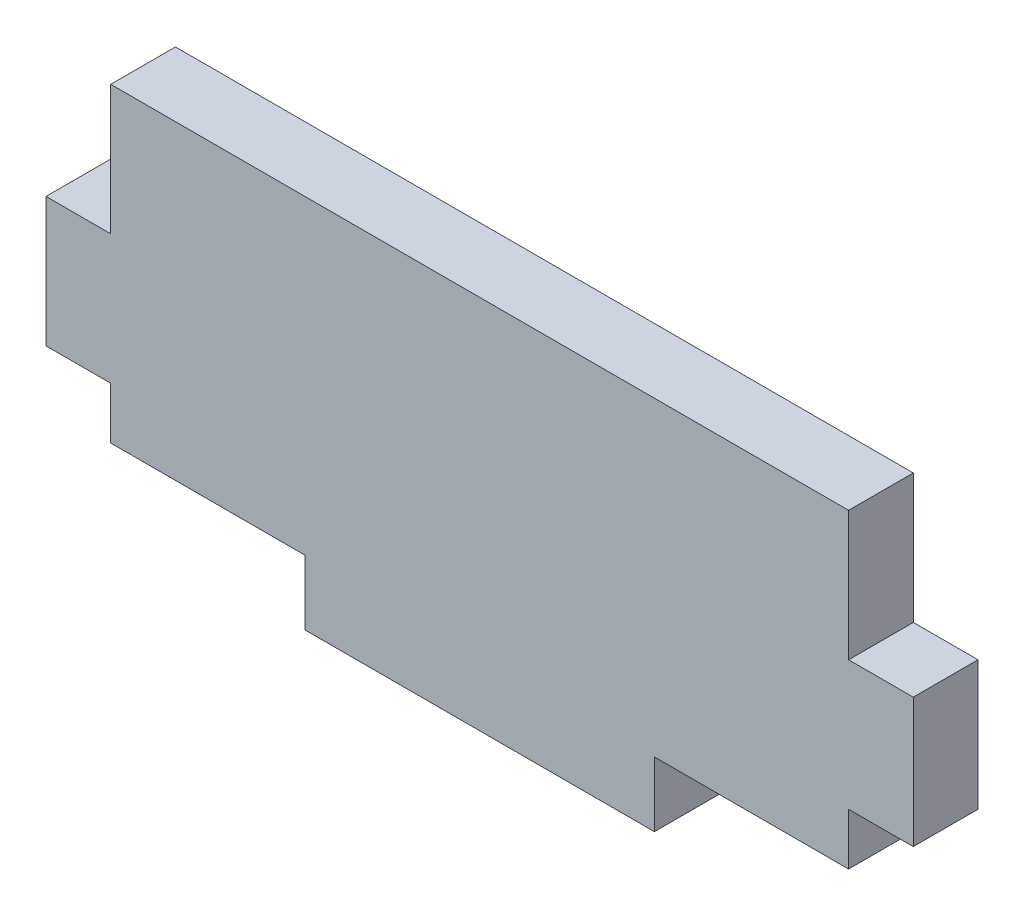
ISO-10303-21;
HEADER;
FILE_DESCRIPTION(('STEP AP214'),'2;1');
FILE_NAME('part.step','',(''),(''),'','','');
FILE_SCHEMA(('AUTOMOTIVE_DESIGN { 1 0 10303 214 1 1 1 1 }'));
ENDSEC;
DATA;
#1=APPLICATION_CONTEXT('core data for automotive mechanical design processes');
#2=APPLICATION_PROTOCOL_DEFINITION('international standard','automotive_design',2000,#1);
#3=PRODUCT_CONTEXT('',#1,'mechanical');
#4=PRODUCT('Part','Part','',(#3));
#5=PRODUCT_RELATED_PRODUCT_CATEGORY('part','',(#4));
#6=PRODUCT_DEFINITION_FORMATION('','',#4);
#7=PRODUCT_DEFINITION_CONTEXT('part definition',#1,'design');
#8=PRODUCT_DEFINITION('design','',#6,#7);
#9=PRODUCT_DEFINITION_SHAPE('','',#8);
#10=(LENGTH_UNIT() NAMED_UNIT(*) SI_UNIT(.MILLI.,.METRE.));
#11=(NAMED_UNIT(*) PLANE_ANGLE_UNIT() SI_UNIT($,.RADIAN.));
#12=(NAMED_UNIT(*) SI_UNIT($,.STERADIAN.) SOLID_ANGLE_UNIT());
#13=UNCERTAINTY_MEASURE_WITH_UNIT(LENGTH_MEASURE(1.E-05),#10,'distance_accuracy_value','');
#14=(GEOMETRIC_REPRESENTATION_CONTEXT(3) GLOBAL_UNCERTAINTY_ASSIGNED_CONTEXT((#13)) GLOBAL_UNIT_ASSIGNED_CONTEXT((#10,
#11,#12)) REPRESENTATION_CONTEXT('',''));
#15=CARTESIAN_POINT('',(0.,0.,0.));
#16=DIRECTION('',(0.,0.,1.));
#17=DIRECTION('',(1.,0.,0.));
#18=AXIS2_PLACEMENT_3D('',#15,#16,#17);
#19=CARTESIAN_POINT('',(0.,5.08,0.));
#20=DIRECTION('',(0.,-1.,0.));
#21=DIRECTION('',(0.,0.,-1.));
#22=AXIS2_PLACEMENT_3D('',#19,#20,#21);
#23=PLANE('',#22);
#24=DIRECTION('',(1.,0.,0.));
#25=VECTOR('',#24,1.);
#26=CARTESIAN_POINT('',(0.,5.08,6.35));
#27=LINE('',#26,#25);
#28=CARTESIAN_POINT('',(-6.34584658399047,5.08,6.35));
#29=VERTEX_POINT('',#28);
#30=CARTESIAN_POINT('',(0.00415341600952523,5.08,6.35));
#31=VERTEX_POINT('',#30);
#32=EDGE_CURVE('E216',#29,#31,#27,.T.);
#33=ORIENTED_EDGE('',*,*,#32,.F.);
#34=DIRECTION('',(0.,0.,1.));
#35=VECTOR('',#34,1.);
#36=CARTESIAN_POINT('',(-6.34584658399047,5.08,0.));
#37=LINE('',#36,#35);
#38=CARTESIAN_POINT('',(-6.34584658399047,5.08,0.));
#39=VERTEX_POINT('',#38);
#40=EDGE_CURVE('E11',#39,#29,#37,.T.);
#41=ORIENTED_EDGE('',*,*,#40,.F.);
#42=DIRECTION('',(1.,0.,0.));
#43=VECTOR('',#42,1.);
#44=CARTESIAN_POINT('',(0.,5.08,0.));
#45=LINE('',#44,#43);
#46=CARTESIAN_POINT('',(0.00415341600952523,5.08,0.));
#47=VERTEX_POINT('',#46);
#48=EDGE_CURVE('E178',#39,#47,#45,.T.);
#49=ORIENTED_EDGE('',*,*,#48,.T.);
#50=DIRECTION('',(0.,0.,1.));
#51=VECTOR('',#50,1.);
#52=CARTESIAN_POINT('',(0.00415341600952523,5.08,0.));
#53=LINE('',#52,#51);
#54=EDGE_CURVE('E35',#47,#31,#53,.T.);
#55=ORIENTED_EDGE('',*,*,#54,.T.);
#56=EDGE_LOOP('',(#33,#41,#49,#55));
#57=FACE_BOUND('',#56,.T.);
#58=ADVANCED_FACE('F32',(#57),#23,.T.);
#59=CARTESIAN_POINT('',(-6.34584658399047,0.,0.));
#60=DIRECTION('',(1.,0.,0.));
#61=DIRECTION('',(0.,0.,-1.));
#62=AXIS2_PLACEMENT_3D('',#59,#60,#61);
#63=PLANE('',#62);
#64=DIRECTION('',(0.,1.,0.));
#65=VECTOR('',#64,1.);
#66=CARTESIAN_POINT('',(-6.34584658399047,0.,6.35));
#67=LINE('',#66,#65);
#68=CARTESIAN_POINT('',(-6.34584658399047,17.78,6.35));
#69=VERTEX_POINT('',#68);
#70=EDGE_CURVE('E101',#29,#69,#67,.T.);
#71=ORIENTED_EDGE('',*,*,#70,.T.);
#72=DIRECTION('',(0.,0.,1.));
#73=VECTOR('',#72,1.);
#74=CARTESIAN_POINT('',(-6.34584658399047,17.78,0.));
#75=LINE('',#74,#73);
#76=CARTESIAN_POINT('',(-6.34584658399047,17.78,0.));
#77=VERTEX_POINT('',#76);
#78=EDGE_CURVE('E41',#77,#69,#75,.T.);
#79=ORIENTED_EDGE('',*,*,#78,.F.);
#80=DIRECTION('',(0.,1.,0.));
#81=VECTOR('',#80,1.);
#82=CARTESIAN_POINT('',(-6.34584658399047,0.,0.));
#83=LINE('',#82,#81);
#84=EDGE_CURVE('E156',#39,#77,#83,.T.);
#85=ORIENTED_EDGE('',*,*,#84,.F.);
#86=ORIENTED_EDGE('',*,*,#40,.T.);
#87=EDGE_LOOP('',(#71,#79,#85,#86));
#88=FACE_BOUND('',#87,.T.);
#89=ADVANCED_FACE('F292',(#88),#63,.F.);
#90=CARTESIAN_POINT('',(0.,17.78,0.));
#91=DIRECTION('',(0.,-1.,0.));
#92=DIRECTION('',(1.,0.,0.));
#93=AXIS2_PLACEMENT_3D('',#90,#91,#92);
#94=PLANE('',#93);
#95=DIRECTION('',(1.,0.,0.));
#96=VECTOR('',#95,1.);
#97=CARTESIAN_POINT('',(0.,17.78,6.35));
#98=LINE('',#97,#96);
#99=CARTESIAN_POINT('',(0.00415341600952523,17.78,6.35));
#100=VERTEX_POINT('',#99);
#101=EDGE_CURVE('E163',#69,#100,#98,.T.);
#102=ORIENTED_EDGE('',*,*,#101,.T.);
#103=DIRECTION('',(0.,0.,1.));
#104=VECTOR('',#103,1.);
#105=CARTESIAN_POINT('',(0.00415341600952523,17.78,0.));
#106=LINE('',#105,#104);
#107=CARTESIAN_POINT('',(0.00415341600952523,17.78,0.));
#108=VERTEX_POINT('',#107);
#109=EDGE_CURVE('E160',#108,#100,#106,.T.);
#110=ORIENTED_EDGE('',*,*,#109,.F.);
#111=DIRECTION('',(1.,0.,0.));
#112=VECTOR('',#111,1.);
#113=CARTESIAN_POINT('',(0.,17.78,0.));
#114=LINE('',#113,#112);
#115=EDGE_CURVE('E150',#77,#108,#114,.T.);
#116=ORIENTED_EDGE('',*,*,#115,.F.);
#117=ORIENTED_EDGE('',*,*,#78,.T.);
#118=EDGE_LOOP('',(#102,#110,#116,#117));
#119=FACE_BOUND('',#118,.T.);
#120=ADVANCED_FACE('F161',(#119),#94,.F.);
#121=CARTESIAN_POINT('',(0.00415341600952523,0.,0.));
#122=DIRECTION('',(1.,0.,0.));
#123=DIRECTION('',(0.,0.,-1.));
#124=AXIS2_PLACEMENT_3D('',#121,#122,#123);
#125=PLANE('',#124);
#126=DIRECTION('',(0.,1.,0.));
#127=VECTOR('',#126,1.);
#128=CARTESIAN_POINT('',(0.00415341600952523,0.,6.35));
#129=LINE('',#128,#127);
#130=CARTESIAN_POINT('',(0.00415341600952523,30.48,6.35));
#131=VERTEX_POINT('',#130);
#132=EDGE_CURVE('E183',#100,#131,#129,.T.);
#133=ORIENTED_EDGE('',*,*,#132,.T.);
#134=DIRECTION('',(0.,0.,1.));
#135=VECTOR('',#134,1.);
#136=CARTESIAN_POINT('',(0.00415341600952523,30.48,0.));
#137=LINE('',#136,#135);
#138=CARTESIAN_POINT('',(0.00415341600952523,30.48,0.));
#139=VERTEX_POINT('',#138);
#140=EDGE_CURVE('E166',#139,#131,#137,.T.);
#141=ORIENTED_EDGE('',*,*,#140,.F.);
#142=DIRECTION('',(0.,1.,0.));
#143=VECTOR('',#142,1.);
#144=CARTESIAN_POINT('',(0.00415341600952523,0.,0.));
#145=LINE('',#144,#143);
#146=EDGE_CURVE('E154',#108,#139,#145,.T.);
#147=ORIENTED_EDGE('',*,*,#146,.F.);
#148=ORIENTED_EDGE('',*,*,#109,.T.);
#149=EDGE_LOOP('',(#133,#141,#147,#148));
#150=FACE_BOUND('',#149,.T.);
#151=ADVANCED_FACE('F168',(#150),#125,.F.);
#152=CARTESIAN_POINT('',(0.,30.48,0.));
#153=DIRECTION('',(0.,-1.,0.));
#154=DIRECTION('',(0.,0.,-1.));
#155=AXIS2_PLACEMENT_3D('',#152,#153,#154);
#156=PLANE('',#155);
#157=DIRECTION('',(1.,0.,0.));
#158=VECTOR('',#157,1.);
#159=CARTESIAN_POINT('',(0.,30.48,6.35));
#160=LINE('',#159,#158);
#161=CARTESIAN_POINT('',(72.3941534160095,30.48,6.35));
#162=VERTEX_POINT('',#161);
#163=EDGE_CURVE('E245',#131,#162,#160,.T.);
#164=ORIENTED_EDGE('',*,*,#163,.T.);
#165=DIRECTION('',(0.,0.,1.));
#166=VECTOR('',#165,1.);
#167=CARTESIAN_POINT('',(72.3941534160095,30.48,0.));
#168=LINE('',#167,#166);
#169=CARTESIAN_POINT('',(72.3941534160095,30.48,0.));
#170=VERTEX_POINT('',#169);
#171=EDGE_CURVE('E189',#170,#162,#168,.T.);
#172=ORIENTED_EDGE('',*,*,#171,.F.);
#173=DIRECTION('',(1.,0.,0.));
#174=VECTOR('',#173,1.);
#175=CARTESIAN_POINT('',(0.,30.48,0.));
#176=LINE('',#175,#174);
#177=EDGE_CURVE('E171',#139,#170,#176,.T.);
#178=ORIENTED_EDGE('',*,*,#177,.F.);
#179=ORIENTED_EDGE('',*,*,#140,.T.);
#180=EDGE_LOOP('',(#164,#172,#178,#179));
#181=FACE_BOUND('',#180,.T.);
#182=ADVANCED_FACE('F306',(#181),#156,.F.);
#183=CARTESIAN_POINT('',(72.3941534160095,0.,0.));
#184=DIRECTION('',(-1.,0.,0.));
#185=DIRECTION('',(0.,0.,1.));
#186=AXIS2_PLACEMENT_3D('',#183,#184,#185);
#187=PLANE('',#186);
#188=DIRECTION('',(0.,-1.,0.));
#189=VECTOR('',#188,1.);
#190=CARTESIAN_POINT('',(72.3941534160095,0.,6.35));
#191=LINE('',#190,#189);
#192=CARTESIAN_POINT('',(72.3941534160095,17.78,6.35));
#193=VERTEX_POINT('',#192);
#194=EDGE_CURVE('E238',#162,#193,#191,.T.);
#195=ORIENTED_EDGE('',*,*,#194,.T.);
#196=DIRECTION('',(0.,0.,1.));
#197=VECTOR('',#196,1.);
#198=CARTESIAN_POINT('',(72.3941534160095,17.78,0.));
#199=LINE('',#198,#197);
#200=CARTESIAN_POINT('',(72.3941534160095,17.78,0.));
#201=VERTEX_POINT('',#200);
#202=EDGE_CURVE('E192',#201,#193,#199,.T.);
#203=ORIENTED_EDGE('',*,*,#202,.F.);
#204=DIRECTION('',(0.,-1.,0.));
#205=VECTOR('',#204,1.);
#206=CARTESIAN_POINT('',(72.3941534160095,0.,0.));
#207=LINE('',#206,#205);
#208=EDGE_CURVE('E173',#170,#201,#207,.T.);
#209=ORIENTED_EDGE('',*,*,#208,.F.);
#210=ORIENTED_EDGE('',*,*,#171,.T.);
#211=EDGE_LOOP('',(#195,#203,#209,#210));
#212=FACE_BOUND('',#211,.T.);
#213=ADVANCED_FACE('F253',(#212),#187,.F.);
#214=CARTESIAN_POINT('',(0.,17.78,0.));
#215=DIRECTION('',(0.,1.,0.));
#216=DIRECTION('',(0.,0.,1.));
#217=AXIS2_PLACEMENT_3D('',#214,#215,#216);
#218=PLANE('',#217);
#219=DIRECTION('',(-1.,0.,0.));
#220=VECTOR('',#219,1.);
#221=CARTESIAN_POINT('',(0.,17.78,6.35));
#222=LINE('',#221,#220);
#223=CARTESIAN_POINT('',(78.74,17.78,6.35));
#224=VERTEX_POINT('',#223);
#225=EDGE_CURVE('E243',#224,#193,#222,.T.);
#226=ORIENTED_EDGE('',*,*,#225,.F.);
#227=DIRECTION('',(0.,0.,1.));
#228=VECTOR('',#227,1.);
#229=CARTESIAN_POINT('',(78.74,17.78,0.));
#230=LINE('',#229,#228);
#231=CARTESIAN_POINT('',(78.74,17.78,0.));
#232=VERTEX_POINT('',#231);
#233=EDGE_CURVE('E194',#232,#224,#230,.T.);
#234=ORIENTED_EDGE('',*,*,#233,.F.);
#235=DIRECTION('',(-1.,0.,0.));
#236=VECTOR('',#235,1.);
#237=CARTESIAN_POINT('',(0.,17.78,0.));
#238=LINE('',#237,#236);
#239=EDGE_CURVE('E264',#232,#201,#238,.T.);
#240=ORIENTED_EDGE('',*,*,#239,.T.);
#241=ORIENTED_EDGE('',*,*,#202,.T.);
#242=EDGE_LOOP('',(#226,#234,#240,#241));
#243=FACE_BOUND('',#242,.T.);
#244=ADVANCED_FACE('F262',(#243),#218,.T.);
#245=CARTESIAN_POINT('',(78.74,0.,0.));
#246=DIRECTION('',(1.,0.,0.));
#247=DIRECTION('',(0.,0.,-1.));
#248=AXIS2_PLACEMENT_3D('',#245,#246,#247);
#249=PLANE('',#248);
#250=DIRECTION('',(0.,1.,0.));
#251=VECTOR('',#250,1.);
#252=CARTESIAN_POINT('',(78.74,0.,6.35));
#253=LINE('',#252,#251);
#254=CARTESIAN_POINT('',(78.74,5.07999999999999,6.35));
#255=VERTEX_POINT('',#254);
#256=EDGE_CURVE('E240',#255,#224,#253,.T.);
#257=ORIENTED_EDGE('',*,*,#256,.F.);
#258=DIRECTION('',(0.,0.,1.));
#259=VECTOR('',#258,1.);
#260=CARTESIAN_POINT('',(78.74,5.07999999999999,0.));
#261=LINE('',#260,#259);
#262=CARTESIAN_POINT('',(78.74,5.07999999999999,0.));
#263=VERTEX_POINT('',#262);
#264=EDGE_CURVE('E196',#263,#255,#261,.T.);
#265=ORIENTED_EDGE('',*,*,#264,.F.);
#266=DIRECTION('',(0.,1.,0.));
#267=VECTOR('',#266,1.);
#268=CARTESIAN_POINT('',(78.74,0.,0.));
#269=LINE('',#268,#267);
#270=EDGE_CURVE('E267',#263,#232,#269,.T.);
#271=ORIENTED_EDGE('',*,*,#270,.T.);
#272=ORIENTED_EDGE('',*,*,#233,.T.);
#273=EDGE_LOOP('',(#257,#265,#271,#272));
#274=FACE_BOUND('',#273,.T.);
#275=ADVANCED_FACE('F314',(#274),#249,.T.);
#276=CARTESIAN_POINT('',(0.,5.07999999999998,0.));
#277=DIRECTION('',(0.,1.,0.));
#278=DIRECTION('',(-1.,0.,0.));
#279=AXIS2_PLACEMENT_3D('',#276,#277,#278);
#280=PLANE('',#279);
#281=DIRECTION('',(-1.,0.,0.));
#282=VECTOR('',#281,1.);
#283=CARTESIAN_POINT('',(0.,5.07999999999998,6.35));
#284=LINE('',#283,#282);
#285=CARTESIAN_POINT('',(72.3941534160095,5.07999999999999,6.35));
#286=VERTEX_POINT('',#285);
#287=EDGE_CURVE('E237',#255,#286,#284,.T.);
#288=ORIENTED_EDGE('',*,*,#287,.T.);
#289=DIRECTION('',(0.,0.,1.));
#290=VECTOR('',#289,1.);
#291=CARTESIAN_POINT('',(72.3941534160095,5.07999999999999,0.));
#292=LINE('',#291,#290);
#293=CARTESIAN_POINT('',(72.3941534160095,5.07999999999999,0.));
#294=VERTEX_POINT('',#293);
#295=EDGE_CURVE('E198',#294,#286,#292,.T.);
#296=ORIENTED_EDGE('',*,*,#295,.F.);
#297=DIRECTION('',(-1.,0.,0.));
#298=VECTOR('',#297,1.);
#299=CARTESIAN_POINT('',(0.,5.07999999999998,0.));
#300=LINE('',#299,#298);
#301=EDGE_CURVE('E271',#263,#294,#300,.T.);
#302=ORIENTED_EDGE('',*,*,#301,.F.);
#303=ORIENTED_EDGE('',*,*,#264,.T.);
#304=EDGE_LOOP('',(#288,#296,#302,#303));
#305=FACE_BOUND('',#304,.T.);
#306=ADVANCED_FACE('F317',(#305),#280,.F.);
#307=CARTESIAN_POINT('',(72.3941534160095,0.,6.35));
#308=VERTEX_POINT('',#307);
#309=EDGE_CURVE('E234',#286,#308,#191,.T.);
#310=ORIENTED_EDGE('',*,*,#309,.T.);
#311=DIRECTION('',(0.,0.,1.));
#312=VECTOR('',#311,1.);
#313=CARTESIAN_POINT('',(72.3941534160095,0.,0.));
#314=LINE('',#313,#312);
#315=CARTESIAN_POINT('',(72.3941534160095,0.,0.));
#316=VERTEX_POINT('',#315);
#317=EDGE_CURVE('E201',#316,#308,#314,.T.);
#318=ORIENTED_EDGE('',*,*,#317,.F.);
#319=EDGE_CURVE('E270',#294,#316,#207,.T.);
#320=ORIENTED_EDGE('',*,*,#319,.F.);
#321=ORIENTED_EDGE('',*,*,#295,.T.);
#322=EDGE_LOOP('',(#310,#318,#320,#321));
#323=FACE_BOUND('',#322,.T.);
#324=ADVANCED_FACE('F311',(#323),#187,.F.);
#325=CARTESIAN_POINT('',(0.,0.,0.));
#326=DIRECTION('',(0.,-1.,0.));
#327=DIRECTION('',(0.,0.,-1.));
#328=AXIS2_PLACEMENT_3D('',#325,#326,#327);
#329=PLANE('',#328);
#330=DIRECTION('',(1.,0.,0.));
#331=VECTOR('',#330,1.);
#332=CARTESIAN_POINT('',(0.,0.,6.35));
#333=LINE('',#332,#331);
#334=CARTESIAN_POINT('',(53.3441534160095,0.,6.35));
#335=VERTEX_POINT('',#334);
#336=EDGE_CURVE('E225',#335,#308,#333,.T.);
#337=ORIENTED_EDGE('',*,*,#336,.F.);
#338=DIRECTION('',(0.,0.,1.));
#339=VECTOR('',#338,1.);
#340=CARTESIAN_POINT('',(53.3441534160095,0.,0.));
#341=LINE('',#340,#339);
#342=CARTESIAN_POINT('',(53.3441534160095,0.,0.));
#343=VERTEX_POINT('',#342);
#344=EDGE_CURVE('E203',#343,#335,#341,.T.);
#345=ORIENTED_EDGE('',*,*,#344,.F.);
#346=DIRECTION('',(1.,0.,0.));
#347=VECTOR('',#346,1.);
#348=CARTESIAN_POINT('',(0.,0.,0.));
#349=LINE('',#348,#347);
#350=EDGE_CURVE('E181',#343,#316,#349,.T.);
#351=ORIENTED_EDGE('',*,*,#350,.T.);
#352=ORIENTED_EDGE('',*,*,#317,.T.);
#353=EDGE_LOOP('',(#337,#345,#351,#352));
#354=FACE_BOUND('',#353,.T.);
#355=ADVANCED_FACE('F322',(#354),#329,.T.);
#356=CARTESIAN_POINT('',(53.3441534160095,0.,0.));
#357=DIRECTION('',(-1.,0.,0.));
#358=DIRECTION('',(0.,0.,1.));
#359=AXIS2_PLACEMENT_3D('',#356,#357,#358);
#360=PLANE('',#359);
#361=DIRECTION('',(0.,-1.,0.));
#362=VECTOR('',#361,1.);
#363=CARTESIAN_POINT('',(53.3441534160095,0.,6.35));
#364=LINE('',#363,#362);
#365=CARTESIAN_POINT('',(53.3441534160095,-6.35,6.35));
#366=VERTEX_POINT('',#365);
#367=EDGE_CURVE('E231',#335,#366,#364,.T.);
#368=ORIENTED_EDGE('',*,*,#367,.T.);
#369=DIRECTION('',(0.,0.,1.));
#370=VECTOR('',#369,1.);
#371=CARTESIAN_POINT('',(53.3441534160095,-6.35,0.));
#372=LINE('',#371,#370);
#373=CARTESIAN_POINT('',(53.3441534160095,-6.35,0.));
#374=VERTEX_POINT('',#373);
#375=EDGE_CURVE('E205',#374,#366,#372,.T.);
#376=ORIENTED_EDGE('',*,*,#375,.F.);
#377=DIRECTION('',(0.,-1.,0.));
#378=VECTOR('',#377,1.);
#379=CARTESIAN_POINT('',(53.3441534160095,0.,0.));
#380=LINE('',#379,#378);
#381=EDGE_CURVE('E275',#343,#374,#380,.T.);
#382=ORIENTED_EDGE('',*,*,#381,.F.);
#383=ORIENTED_EDGE('',*,*,#344,.T.);
#384=EDGE_LOOP('',(#368,#376,#382,#383));
#385=FACE_BOUND('',#384,.T.);
#386=ADVANCED_FACE('F325',(#385),#360,.F.);
#387=CARTESIAN_POINT('',(0.,-6.35,0.));
#388=DIRECTION('',(0.,-1.,0.));
#389=DIRECTION('',(0.,0.,-1.));
#390=AXIS2_PLACEMENT_3D('',#387,#388,#389);
#391=PLANE('',#390);
#392=DIRECTION('',(1.,0.,0.));
#393=VECTOR('',#392,1.);
#394=CARTESIAN_POINT('',(0.,-6.35,6.35));
#395=LINE('',#394,#393);
#396=CARTESIAN_POINT('',(19.0541534160095,-6.35,6.35));
#397=VERTEX_POINT('',#396);
#398=EDGE_CURVE('E228',#397,#366,#395,.T.);
#399=ORIENTED_EDGE('',*,*,#398,.F.);
#400=DIRECTION('',(0.,0.,1.));
#401=VECTOR('',#400,1.);
#402=CARTESIAN_POINT('',(19.0541534160095,-6.35,0.));
#403=LINE('',#402,#401);
#404=CARTESIAN_POINT('',(19.0541534160095,-6.35,0.));
#405=VERTEX_POINT('',#404);
#406=EDGE_CURVE('E207',#405,#397,#403,.T.);
#407=ORIENTED_EDGE('',*,*,#406,.F.);
#408=DIRECTION('',(1.,0.,0.));
#409=VECTOR('',#408,1.);
#410=CARTESIAN_POINT('',(0.,-6.35,0.));
#411=LINE('',#410,#409);
#412=EDGE_CURVE('E277',#405,#374,#411,.T.);
#413=ORIENTED_EDGE('',*,*,#412,.T.);
#414=ORIENTED_EDGE('',*,*,#375,.T.);
#415=EDGE_LOOP('',(#399,#407,#413,#414));
#416=FACE_BOUND('',#415,.T.);
#417=ADVANCED_FACE('F329',(#416),#391,.T.);
#418=CARTESIAN_POINT('',(19.0541534160095,0.,0.));
#419=DIRECTION('',(-1.,0.,0.));
#420=DIRECTION('',(0.,0.,1.));
#421=AXIS2_PLACEMENT_3D('',#418,#419,#420);
#422=PLANE('',#421);
#423=DIRECTION('',(0.,-1.,0.));
#424=VECTOR('',#423,1.);
#425=CARTESIAN_POINT('',(19.0541534160095,0.,6.35));
#426=LINE('',#425,#424);
#427=CARTESIAN_POINT('',(19.0541534160095,0.,6.35));
#428=VERTEX_POINT('',#427);
#429=EDGE_CURVE('E224',#428,#397,#426,.T.);
#430=ORIENTED_EDGE('',*,*,#429,.F.);
#431=DIRECTION('',(0.,0.,1.));
#432=VECTOR('',#431,1.);
#433=CARTESIAN_POINT('',(19.0541534160095,0.,0.));
#434=LINE('',#433,#432);
#435=CARTESIAN_POINT('',(19.0541534160095,0.,0.));
#436=VERTEX_POINT('',#435);
#437=EDGE_CURVE('E209',#436,#428,#434,.T.);
#438=ORIENTED_EDGE('',*,*,#437,.F.);
#439=DIRECTION('',(0.,-1.,0.));
#440=VECTOR('',#439,1.);
#441=CARTESIAN_POINT('',(19.0541534160095,0.,0.));
#442=LINE('',#441,#440);
#443=EDGE_CURVE('E180',#436,#405,#442,.T.);
#444=ORIENTED_EDGE('',*,*,#443,.T.);
#445=ORIENTED_EDGE('',*,*,#406,.T.);
#446=EDGE_LOOP('',(#430,#438,#444,#445));
#447=FACE_BOUND('',#446,.T.);
#448=ADVANCED_FACE('F284',(#447),#422,.T.);
#449=CARTESIAN_POINT('',(0.00415341600952523,0.,6.35));
#450=VERTEX_POINT('',#449);
#451=EDGE_CURVE('E221',#450,#428,#333,.T.);
#452=ORIENTED_EDGE('',*,*,#451,.F.);
#453=DIRECTION('',(0.,0.,1.));
#454=VECTOR('',#453,1.);
#455=CARTESIAN_POINT('',(0.00415341600952523,0.,0.));
#456=LINE('',#455,#454);
#457=CARTESIAN_POINT('',(0.00415341600952523,0.,0.));
#458=VERTEX_POINT('',#457);
#459=EDGE_CURVE('E210',#458,#450,#456,.T.);
#460=ORIENTED_EDGE('',*,*,#459,.F.);
#461=EDGE_CURVE('E177',#458,#436,#349,.T.);
#462=ORIENTED_EDGE('',*,*,#461,.T.);
#463=ORIENTED_EDGE('',*,*,#437,.T.);
#464=EDGE_LOOP('',(#452,#460,#462,#463));
#465=FACE_BOUND('',#464,.T.);
#466=ADVANCED_FACE('F289',(#465),#329,.T.);
#467=EDGE_CURVE('E219',#450,#31,#129,.T.);
#468=ORIENTED_EDGE('',*,*,#467,.T.);
#469=ORIENTED_EDGE('',*,*,#54,.F.);
#470=EDGE_CURVE('E111',#458,#47,#145,.T.);
#471=ORIENTED_EDGE('',*,*,#470,.F.);
#472=ORIENTED_EDGE('',*,*,#459,.T.);
#473=EDGE_LOOP('',(#468,#469,#471,#472));
#474=FACE_BOUND('',#473,.T.);
#475=ADVANCED_FACE('F290',(#474),#125,.F.);
#476=CARTESIAN_POINT('',(0.,0.,0.));
#477=DIRECTION('',(0.,0.,1.));
#478=DIRECTION('',(1.,0.,0.));
#479=AXIS2_PLACEMENT_3D('',#476,#477,#478);
#480=PLANE('',#479);
#481=ORIENTED_EDGE('',*,*,#48,.F.);
#482=ORIENTED_EDGE('',*,*,#84,.T.);
#483=ORIENTED_EDGE('',*,*,#115,.T.);
#484=ORIENTED_EDGE('',*,*,#146,.T.);
#485=ORIENTED_EDGE('',*,*,#177,.T.);
#486=ORIENTED_EDGE('',*,*,#208,.T.);
#487=ORIENTED_EDGE('',*,*,#239,.F.);
#488=ORIENTED_EDGE('',*,*,#270,.F.);
#489=ORIENTED_EDGE('',*,*,#301,.T.);
#490=ORIENTED_EDGE('',*,*,#319,.T.);
#491=ORIENTED_EDGE('',*,*,#350,.F.);
#492=ORIENTED_EDGE('',*,*,#381,.T.);
#493=ORIENTED_EDGE('',*,*,#412,.F.);
#494=ORIENTED_EDGE('',*,*,#443,.F.);
#495=ORIENTED_EDGE('',*,*,#461,.F.);
#496=ORIENTED_EDGE('',*,*,#470,.T.);
#497=EDGE_LOOP('',(#481,#482,#483,#484,#485,#486,#487,#488,#489,#490,#491,#492,#493,#494,#495,#496));
#498=FACE_BOUND('',#497,.T.);
#499=ADVANCED_FACE('F152',(#498),#480,.F.);
#500=CARTESIAN_POINT('',(0.,0.,6.35));
#501=DIRECTION('',(0.,0.,1.));
#502=DIRECTION('',(1.,0.,0.));
#503=AXIS2_PLACEMENT_3D('',#500,#501,#502);
#504=PLANE('',#503);
#505=ORIENTED_EDGE('',*,*,#32,.T.);
#506=ORIENTED_EDGE('',*,*,#467,.F.);
#507=ORIENTED_EDGE('',*,*,#451,.T.);
#508=ORIENTED_EDGE('',*,*,#429,.T.);
#509=ORIENTED_EDGE('',*,*,#398,.T.);
#510=ORIENTED_EDGE('',*,*,#367,.F.);
#511=ORIENTED_EDGE('',*,*,#336,.T.);
#512=ORIENTED_EDGE('',*,*,#309,.F.);
#513=ORIENTED_EDGE('',*,*,#287,.F.);
#514=ORIENTED_EDGE('',*,*,#256,.T.);
#515=ORIENTED_EDGE('',*,*,#225,.T.);
#516=ORIENTED_EDGE('',*,*,#194,.F.);
#517=ORIENTED_EDGE('',*,*,#163,.F.);
#518=ORIENTED_EDGE('',*,*,#132,.F.);
#519=ORIENTED_EDGE('',*,*,#101,.F.);
#520=ORIENTED_EDGE('',*,*,#70,.F.);
#521=EDGE_LOOP('',(#505,#506,#507,#508,#509,#510,#511,#512,#513,#514,#515,#516,#517,#518,#519,#520));
#522=FACE_BOUND('',#521,.T.);
#523=ADVANCED_FACE('F258',(#522),#504,.T.);
#524=CLOSED_SHELL('',(#58,#89,#120,#151,#182,#213,#244,#275,#306,#324,#355,#386,#417,#448,#466,
#475,#499,#523));
#525=MANIFOLD_SOLID_BREP('B2',#524);
#526=ADVANCED_BREP_SHAPE_REPRESENTATION('',(#18,#525),#14);
#527=SHAPE_DEFINITION_REPRESENTATION(#9,#526);
ENDSEC;
END-ISO-10303-21;
